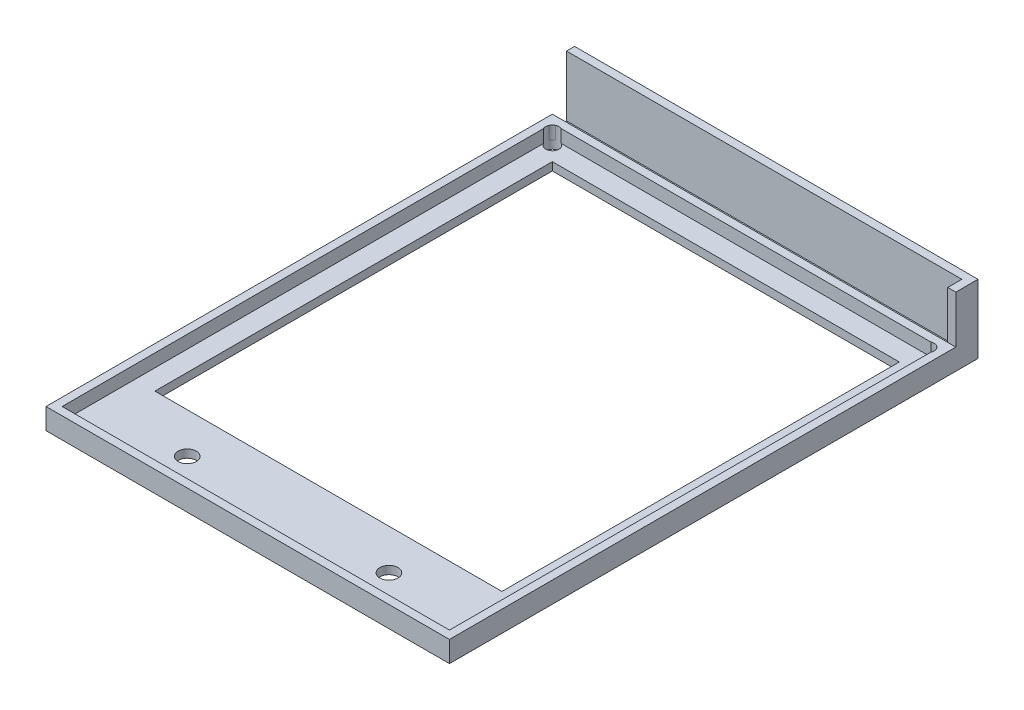
ISO-10303-21;
HEADER;
FILE_DESCRIPTION(('STEP AP214'),'2;1');
FILE_NAME('part.step','',(''),(''),'','','');
FILE_SCHEMA(('AUTOMOTIVE_DESIGN { 1 0 10303 214 1 1 1 1 }'));
ENDSEC;
DATA;
#1=APPLICATION_CONTEXT('core data for automotive mechanical design processes');
#2=APPLICATION_PROTOCOL_DEFINITION('international standard','automotive_design',2000,#1);
#3=PRODUCT_CONTEXT('',#1,'mechanical');
#4=PRODUCT('Part','Part','',(#3));
#5=PRODUCT_RELATED_PRODUCT_CATEGORY('part','',(#4));
#6=PRODUCT_DEFINITION_FORMATION('','',#4);
#7=PRODUCT_DEFINITION_CONTEXT('part definition',#1,'design');
#8=PRODUCT_DEFINITION('design','',#6,#7);
#9=PRODUCT_DEFINITION_SHAPE('','',#8);
#10=(LENGTH_UNIT() NAMED_UNIT(*) SI_UNIT(.MILLI.,.METRE.));
#11=(NAMED_UNIT(*) PLANE_ANGLE_UNIT() SI_UNIT($,.RADIAN.));
#12=(NAMED_UNIT(*) SI_UNIT($,.STERADIAN.) SOLID_ANGLE_UNIT());
#13=UNCERTAINTY_MEASURE_WITH_UNIT(LENGTH_MEASURE(1.E-05),#10,'distance_accuracy_value','');
#14=(GEOMETRIC_REPRESENTATION_CONTEXT(3) GLOBAL_UNCERTAINTY_ASSIGNED_CONTEXT((#13)) GLOBAL_UNIT_ASSIGNED_CONTEXT((#10,
#11,#12)) REPRESENTATION_CONTEXT('',''));
#15=CARTESIAN_POINT('',(0.,0.,0.));
#16=DIRECTION('',(0.,0.,1.));
#17=DIRECTION('',(1.,0.,0.));
#18=AXIS2_PLACEMENT_3D('',#15,#16,#17);
#19=CARTESIAN_POINT('',(-50.,5.2,-62.75));
#20=DIRECTION('',(0.,0.,1.));
#21=DIRECTION('',(1.,0.,0.));
#22=AXIS2_PLACEMENT_3D('',#19,#20,#21);
#23=PLANE('',#22);
#24=DIRECTION('',(0.,-1.,0.));
#25=VECTOR('',#24,1.);
#26=CARTESIAN_POINT('',(48.,17.,-62.75));
#27=LINE('',#26,#25);
#28=CARTESIAN_POINT('',(48.,5.2,-62.75));
#29=VERTEX_POINT('',#28);
#30=CARTESIAN_POINT('',(48.,2.,-62.75));
#31=VERTEX_POINT('',#30);
#32=EDGE_CURVE('E617',#29,#31,#27,.T.);
#33=ORIENTED_EDGE('',*,*,#32,.T.);
#34=DIRECTION('',(1.,0.,0.));
#35=VECTOR('',#34,1.);
#36=CARTESIAN_POINT('',(-50.,2.,-62.75));
#37=LINE('',#36,#35);
#38=CARTESIAN_POINT('',(-50.,2.,-62.75));
#39=VERTEX_POINT('',#38);
#40=EDGE_CURVE('E227',#39,#31,#37,.T.);
#41=ORIENTED_EDGE('',*,*,#40,.F.);
#42=DIRECTION('',(0.,-1.,0.));
#43=VECTOR('',#42,1.);
#44=CARTESIAN_POINT('',(-50.,5.2,-62.75));
#45=LINE('',#44,#43);
#46=CARTESIAN_POINT('',(-50.,5.2,-62.75));
#47=VERTEX_POINT('',#46);
#48=EDGE_CURVE('E321',#47,#39,#45,.T.);
#49=ORIENTED_EDGE('',*,*,#48,.F.);
#50=DIRECTION('',(-1.,0.,0.));
#51=VECTOR('',#50,1.);
#52=CARTESIAN_POINT('',(-50.,5.2,-62.75));
#53=LINE('',#52,#51);
#54=EDGE_CURVE('E50',#29,#47,#53,.T.);
#55=ORIENTED_EDGE('',*,*,#54,.F.);
#56=EDGE_LOOP('',(#33,#41,#49,#55));
#57=FACE_BOUND('',#56,.T.);
#58=ADVANCED_FACE('F35',(#57),#23,.F.);
#59=CARTESIAN_POINT('',(0.,2.,0.));
#60=DIRECTION('',(0.,-1.,0.));
#61=DIRECTION('',(0.,0.,-1.));
#62=AXIS2_PLACEMENT_3D('',#59,#60,#61);
#63=PLANE('',#62);
#64=DIRECTION('',(1.,0.,0.));
#65=VECTOR('',#64,1.);
#66=CARTESIAN_POINT('',(-50.,2.,-66.25));
#67=LINE('',#66,#65);
#68=CARTESIAN_POINT('',(-50.,2.,-66.25));
#69=VERTEX_POINT('',#68);
#70=CARTESIAN_POINT('',(48.,2.,-66.25));
#71=VERTEX_POINT('',#70);
#72=EDGE_CURVE('E619',#69,#71,#67,.T.);
#73=ORIENTED_EDGE('',*,*,#72,.F.);
#74=DIRECTION('',(0.,0.,1.));
#75=VECTOR('',#74,1.);
#76=CARTESIAN_POINT('',(-50.,2.,-62.75));
#77=LINE('',#76,#75);
#78=EDGE_CURVE('E217',#69,#39,#77,.T.);
#79=ORIENTED_EDGE('',*,*,#78,.T.);
#80=ORIENTED_EDGE('',*,*,#40,.T.);
#81=DIRECTION('',(0.,0.,1.));
#82=VECTOR('',#81,1.);
#83=CARTESIAN_POINT('',(48.,2.,-62.75));
#84=LINE('',#83,#82);
#85=EDGE_CURVE('E58',#71,#31,#84,.T.);
#86=ORIENTED_EDGE('',*,*,#85,.F.);
#87=EDGE_LOOP('',(#73,#79,#80,#86));
#88=FACE_BOUND('',#87,.T.);
#89=ADVANCED_FACE('F421',(#88),#63,.F.);
#90=CARTESIAN_POINT('',(0.,2.,0.));
#91=DIRECTION('',(0.,-1.,0.));
#92=DIRECTION('',(0.,0.,-1.));
#93=AXIS2_PLACEMENT_3D('',#90,#91,#92);
#94=PLANE('',#93);
#95=CARTESIAN_POINT('',(-46.5,2.,-59.25));
#96=DIRECTION('',(0.,-1.,0.));
#97=DIRECTION('',(0.,0.,-1.));
#98=AXIS2_PLACEMENT_3D('',#95,#96,#97);
#99=CIRCLE('',#98,1.65);
#100=CARTESIAN_POINT('',(-48.,2.,-58.5626136457566));
#101=VERTEX_POINT('',#100);
#102=CARTESIAN_POINT('',(-45.8126136457567,2.,-60.75));
#103=VERTEX_POINT('',#102);
#104=EDGE_CURVE('E266',#101,#103,#99,.F.);
#105=ORIENTED_EDGE('',*,*,#104,.F.);
#106=DIRECTION('',(0.,0.,1.));
#107=VECTOR('',#106,1.);
#108=CARTESIAN_POINT('',(-48.,2.,60.75));
#109=LINE('',#108,#107);
#110=CARTESIAN_POINT('',(-48.,2.,60.75));
#111=VERTEX_POINT('',#110);
#112=EDGE_CURVE('E360',#101,#111,#109,.T.);
#113=ORIENTED_EDGE('',*,*,#112,.T.);
#114=DIRECTION('',(1.,0.,0.));
#115=VECTOR('',#114,1.);
#116=CARTESIAN_POINT('',(-48.,2.,60.75));
#117=LINE('',#116,#115);
#118=CARTESIAN_POINT('',(48.,2.,60.75));
#119=VERTEX_POINT('',#118);
#120=EDGE_CURVE('E362',#111,#119,#117,.T.);
#121=ORIENTED_EDGE('',*,*,#120,.T.);
#122=DIRECTION('',(0.,0.,-1.));
#123=VECTOR('',#122,1.);
#124=CARTESIAN_POINT('',(48.,2.,60.75));
#125=LINE('',#124,#123);
#126=CARTESIAN_POINT('',(48.,2.,-58.5626136457567));
#127=VERTEX_POINT('',#126);
#128=EDGE_CURVE('E354',#119,#127,#125,.T.);
#129=ORIENTED_EDGE('',*,*,#128,.T.);
#130=CARTESIAN_POINT('',(46.5,2.,-59.25));
#131=DIRECTION('',(0.,-1.,0.));
#132=DIRECTION('',(0.,0.,-1.));
#133=AXIS2_PLACEMENT_3D('',#130,#131,#132);
#134=CIRCLE('',#133,1.65);
#135=CARTESIAN_POINT('',(45.8126136457567,2.,-60.75));
#136=VERTEX_POINT('',#135);
#137=EDGE_CURVE('E251',#136,#127,#134,.F.);
#138=ORIENTED_EDGE('',*,*,#137,.F.);
#139=DIRECTION('',(-1.,0.,0.));
#140=VECTOR('',#139,1.);
#141=CARTESIAN_POINT('',(-48.,2.,-60.75));
#142=LINE('',#141,#140);
#143=EDGE_CURVE('E357',#136,#103,#142,.T.);
#144=ORIENTED_EDGE('',*,*,#143,.T.);
#145=EDGE_LOOP('',(#105,#113,#121,#129,#138,#144));
#146=FACE_BOUND('',#145,.T.);
#147=CARTESIAN_POINT('',(-25.,2.,52.75));
#148=DIRECTION('',(0.,-1.,0.));
#149=DIRECTION('',(0.,0.,-1.));
#150=AXIS2_PLACEMENT_3D('',#147,#148,#149);
#151=CIRCLE('',#150,2.25);
#152=CARTESIAN_POINT('',(-25.,2.,55.));
#153=VERTEX_POINT('',#152);
#154=EDGE_CURVE('E235',#153,#153,#151,.F.);
#155=ORIENTED_EDGE('',*,*,#154,.F.);
#156=EDGE_LOOP('',(#155));
#157=FACE_BOUND('',#156,.T.);
#158=CARTESIAN_POINT('',(25.,2.,52.75));
#159=DIRECTION('',(0.,-1.,0.));
#160=DIRECTION('',(0.,0.,-1.));
#161=AXIS2_PLACEMENT_3D('',#158,#159,#160);
#162=CIRCLE('',#161,2.25);
#163=CARTESIAN_POINT('',(25.,2.,55.));
#164=VERTEX_POINT('',#163);
#165=EDGE_CURVE('E238',#164,#164,#162,.F.);
#166=ORIENTED_EDGE('',*,*,#165,.F.);
#167=EDGE_LOOP('',(#166));
#168=FACE_BOUND('',#167,.T.);
#169=DIRECTION('',(0.,0.,1.));
#170=VECTOR('',#169,1.);
#171=CARTESIAN_POINT('',(-43.,2.,-55.75));
#172=LINE('',#171,#170);
#173=CARTESIAN_POINT('',(-43.,2.,-55.75));
#174=VERTEX_POINT('',#173);
#175=CARTESIAN_POINT('',(-43.,2.,42.75));
#176=VERTEX_POINT('',#175);
#177=EDGE_CURVE('E324',#174,#176,#172,.T.);
#178=ORIENTED_EDGE('',*,*,#177,.F.);
#179=DIRECTION('',(-1.,0.,0.));
#180=VECTOR('',#179,1.);
#181=CARTESIAN_POINT('',(-43.,2.,-55.75));
#182=LINE('',#181,#180);
#183=CARTESIAN_POINT('',(43.,2.,-55.75));
#184=VERTEX_POINT('',#183);
#185=EDGE_CURVE('E332',#184,#174,#182,.T.);
#186=ORIENTED_EDGE('',*,*,#185,.F.);
#187=DIRECTION('',(0.,0.,-1.));
#188=VECTOR('',#187,1.);
#189=CARTESIAN_POINT('',(43.,2.,-55.75));
#190=LINE('',#189,#188);
#191=CARTESIAN_POINT('',(43.,2.,42.75));
#192=VERTEX_POINT('',#191);
#193=EDGE_CURVE('E329',#192,#184,#190,.T.);
#194=ORIENTED_EDGE('',*,*,#193,.F.);
#195=DIRECTION('',(1.,0.,0.));
#196=VECTOR('',#195,1.);
#197=CARTESIAN_POINT('',(-43.,2.,42.75));
#198=LINE('',#197,#196);
#199=EDGE_CURVE('E326',#176,#192,#198,.T.);
#200=ORIENTED_EDGE('',*,*,#199,.F.);
#201=EDGE_LOOP('',(#178,#186,#194,#200));
#202=FACE_BOUND('',#201,.T.);
#203=ADVANCED_FACE('F404',(#146,#157,#168,#202),#94,.F.);
#204=CARTESIAN_POINT('',(-48.,5.2,-60.75));
#205=DIRECTION('',(0.,0.,1.));
#206=DIRECTION('',(1.,0.,0.));
#207=AXIS2_PLACEMENT_3D('',#204,#205,#206);
#208=PLANE('',#207);
#209=DIRECTION('',(-1.,0.,0.));
#210=VECTOR('',#209,1.);
#211=CARTESIAN_POINT('',(-48.,5.2,-60.75));
#212=LINE('',#211,#210);
#213=CARTESIAN_POINT('',(45.8126136457567,5.2,-60.75));
#214=VERTEX_POINT('',#213);
#215=CARTESIAN_POINT('',(-45.8126136457567,5.2,-60.75));
#216=VERTEX_POINT('',#215);
#217=EDGE_CURVE('E292',#214,#216,#212,.T.);
#218=ORIENTED_EDGE('',*,*,#217,.T.);
#219=DIRECTION('',(0.,-1.,0.));
#220=VECTOR('',#219,1.);
#221=CARTESIAN_POINT('',(-45.8126136457567,5.201,-60.75));
#222=LINE('',#221,#220);
#223=EDGE_CURVE('E260',#216,#103,#222,.T.);
#224=ORIENTED_EDGE('',*,*,#223,.T.);
#225=ORIENTED_EDGE('',*,*,#143,.F.);
#226=DIRECTION('',(0.,-1.,0.));
#227=VECTOR('',#226,1.);
#228=CARTESIAN_POINT('',(45.8126136457567,5.201,-60.75));
#229=LINE('',#228,#227);
#230=EDGE_CURVE('E246',#136,#214,#229,.F.);
#231=ORIENTED_EDGE('',*,*,#230,.T.);
#232=EDGE_LOOP('',(#218,#224,#225,#231));
#233=FACE_BOUND('',#232,.T.);
#234=ADVANCED_FACE('F385',(#233),#208,.T.);
#235=CARTESIAN_POINT('',(-48.,5.2,-60.75));
#236=DIRECTION('',(1.,0.,0.));
#237=DIRECTION('',(0.,0.,-1.));
#238=AXIS2_PLACEMENT_3D('',#235,#236,#237);
#239=PLANE('',#238);
#240=ORIENTED_EDGE('',*,*,#112,.F.);
#241=DIRECTION('',(0.,-1.,0.));
#242=VECTOR('',#241,1.);
#243=CARTESIAN_POINT('',(-48.,5.201,-58.5626136457566));
#244=LINE('',#243,#242);
#245=CARTESIAN_POINT('',(-48.,5.2,-58.5626136457566));
#246=VERTEX_POINT('',#245);
#247=EDGE_CURVE('E272',#101,#246,#244,.F.);
#248=ORIENTED_EDGE('',*,*,#247,.T.);
#249=DIRECTION('',(0.,0.,1.));
#250=VECTOR('',#249,1.);
#251=CARTESIAN_POINT('',(-48.,5.2,-60.75));
#252=LINE('',#251,#250);
#253=CARTESIAN_POINT('',(-48.,5.2,60.75));
#254=VERTEX_POINT('',#253);
#255=EDGE_CURVE('E284',#246,#254,#252,.T.);
#256=ORIENTED_EDGE('',*,*,#255,.T.);
#257=DIRECTION('',(0.,-1.,0.));
#258=VECTOR('',#257,1.);
#259=CARTESIAN_POINT('',(-48.,5.2,60.75));
#260=LINE('',#259,#258);
#261=EDGE_CURVE('E298',#254,#111,#260,.T.);
#262=ORIENTED_EDGE('',*,*,#261,.T.);
#263=EDGE_LOOP('',(#240,#248,#256,#262));
#264=FACE_BOUND('',#263,.T.);
#265=ADVANCED_FACE('F397',(#264),#239,.T.);
#266=CARTESIAN_POINT('',(48.,5.2,-60.75));
#267=DIRECTION('',(-1.,0.,0.));
#268=DIRECTION('',(0.,0.,1.));
#269=AXIS2_PLACEMENT_3D('',#266,#267,#268);
#270=PLANE('',#269);
#271=DIRECTION('',(0.,0.,-1.));
#272=VECTOR('',#271,1.);
#273=CARTESIAN_POINT('',(48.,5.2,-60.75));
#274=LINE('',#273,#272);
#275=CARTESIAN_POINT('',(48.,5.2,60.75));
#276=VERTEX_POINT('',#275);
#277=CARTESIAN_POINT('',(48.,5.2,-58.5626136457566));
#278=VERTEX_POINT('',#277);
#279=EDGE_CURVE('E289',#276,#278,#274,.T.);
#280=ORIENTED_EDGE('',*,*,#279,.T.);
#281=DIRECTION('',(0.,-1.,0.));
#282=VECTOR('',#281,1.);
#283=CARTESIAN_POINT('',(48.,5.201,-58.5626136457566));
#284=LINE('',#283,#282);
#285=EDGE_CURVE('E252',#278,#127,#284,.T.);
#286=ORIENTED_EDGE('',*,*,#285,.T.);
#287=ORIENTED_EDGE('',*,*,#128,.F.);
#288=DIRECTION('',(0.,-1.,0.));
#289=VECTOR('',#288,1.);
#290=CARTESIAN_POINT('',(48.,5.2,60.75));
#291=LINE('',#290,#289);
#292=EDGE_CURVE('E295',#276,#119,#291,.T.);
#293=ORIENTED_EDGE('',*,*,#292,.F.);
#294=EDGE_LOOP('',(#280,#286,#287,#293));
#295=FACE_BOUND('',#294,.T.);
#296=ADVANCED_FACE('F407',(#295),#270,.T.);
#297=CARTESIAN_POINT('',(0.,5.2,0.));
#298=DIRECTION('',(0.,-1.,0.));
#299=DIRECTION('',(0.,0.,-1.));
#300=AXIS2_PLACEMENT_3D('',#297,#298,#299);
#301=PLANE('',#300);
#302=DIRECTION('',(0.,0.,-1.));
#303=VECTOR('',#302,1.);
#304=CARTESIAN_POINT('',(50.,5.2,62.75));
#305=LINE('',#304,#303);
#306=CARTESIAN_POINT('',(50.,5.2,62.75));
#307=VERTEX_POINT('',#306);
#308=CARTESIAN_POINT('',(50.,5.2,-62.75));
#309=VERTEX_POINT('',#308);
#310=EDGE_CURVE('E302',#307,#309,#305,.T.);
#311=ORIENTED_EDGE('',*,*,#310,.T.);
#312=EDGE_CURVE('E305',#309,#29,#53,.T.);
#313=ORIENTED_EDGE('',*,*,#312,.T.);
#314=ORIENTED_EDGE('',*,*,#54,.T.);
#315=DIRECTION('',(0.,0.,1.));
#316=VECTOR('',#315,1.);
#317=CARTESIAN_POINT('',(-50.,5.2,62.75));
#318=LINE('',#317,#316);
#319=CARTESIAN_POINT('',(-50.,5.2,62.75));
#320=VERTEX_POINT('',#319);
#321=EDGE_CURVE('E307',#47,#320,#318,.T.);
#322=ORIENTED_EDGE('',*,*,#321,.T.);
#323=DIRECTION('',(1.,0.,0.));
#324=VECTOR('',#323,1.);
#325=CARTESIAN_POINT('',(-50.,5.2,62.75));
#326=LINE('',#325,#324);
#327=EDGE_CURVE('E309',#320,#307,#326,.T.);
#328=ORIENTED_EDGE('',*,*,#327,.T.);
#329=EDGE_LOOP('',(#311,#313,#314,#322,#328));
#330=FACE_BOUND('',#329,.T.);
#331=CARTESIAN_POINT('',(-46.5,5.2,-59.25));
#332=DIRECTION('',(0.,-1.,0.));
#333=DIRECTION('',(0.,0.,-1.));
#334=AXIS2_PLACEMENT_3D('',#331,#332,#333);
#335=CIRCLE('',#334,1.65);
#336=CARTESIAN_POINT('',(-48.,5.2,-59.9373863542434));
#337=VERTEX_POINT('',#336);
#338=EDGE_CURVE('E243',#337,#246,#335,.F.);
#339=ORIENTED_EDGE('',*,*,#338,.F.);
#340=CARTESIAN_POINT('',(-46.5,5.2,-59.25));
#341=DIRECTION('',(0.,-1.,0.));
#342=DIRECTION('',(0.,0.,-1.));
#343=AXIS2_PLACEMENT_3D('',#340,#341,#342);
#344=CIRCLE('',#343,1.65);
#345=CARTESIAN_POINT('',(-47.1873863542434,5.2,-60.75));
#346=VERTEX_POINT('',#345);
#347=EDGE_CURVE('E11',#337,#346,#344,.T.);
#348=ORIENTED_EDGE('',*,*,#347,.T.);
#349=EDGE_CURVE('E234',#216,#346,#335,.F.);
#350=ORIENTED_EDGE('',*,*,#349,.F.);
#351=ORIENTED_EDGE('',*,*,#217,.F.);
#352=CARTESIAN_POINT('',(46.5,5.2,-59.25));
#353=DIRECTION('',(0.,-1.,0.));
#354=DIRECTION('',(0.,0.,-1.));
#355=AXIS2_PLACEMENT_3D('',#352,#353,#354);
#356=CIRCLE('',#355,1.65);
#357=CARTESIAN_POINT('',(47.1873863542434,5.2,-60.75));
#358=VERTEX_POINT('',#357);
#359=EDGE_CURVE('E240',#358,#214,#356,.F.);
#360=ORIENTED_EDGE('',*,*,#359,.F.);
#361=CARTESIAN_POINT('',(46.5,5.2,-59.25));
#362=DIRECTION('',(0.,-1.,0.));
#363=DIRECTION('',(0.,0.,-1.));
#364=AXIS2_PLACEMENT_3D('',#361,#362,#363);
#365=CIRCLE('',#364,1.65);
#366=CARTESIAN_POINT('',(48.,5.2,-59.9373863542434));
#367=VERTEX_POINT('',#366);
#368=EDGE_CURVE('E43',#358,#367,#365,.T.);
#369=ORIENTED_EDGE('',*,*,#368,.T.);
#370=EDGE_CURVE('E239',#278,#367,#356,.F.);
#371=ORIENTED_EDGE('',*,*,#370,.F.);
#372=ORIENTED_EDGE('',*,*,#279,.F.);
#373=DIRECTION('',(1.,0.,0.));
#374=VECTOR('',#373,1.);
#375=CARTESIAN_POINT('',(-48.,5.2,60.75));
#376=LINE('',#375,#374);
#377=EDGE_CURVE('E286',#254,#276,#376,.T.);
#378=ORIENTED_EDGE('',*,*,#377,.F.);
#379=ORIENTED_EDGE('',*,*,#255,.F.);
#380=EDGE_LOOP('',(#339,#348,#350,#351,#360,#369,#371,#372,#378,#379));
#381=FACE_BOUND('',#380,.T.);
#382=ADVANCED_FACE('F374',(#330,#381),#301,.F.);
#383=CARTESIAN_POINT('',(0.,0.,0.));
#384=DIRECTION('',(0.,-1.,0.));
#385=DIRECTION('',(0.,0.,-1.));
#386=AXIS2_PLACEMENT_3D('',#383,#384,#385);
#387=PLANE('',#386);
#388=CARTESIAN_POINT('',(-46.5,0.,-59.25));
#389=DIRECTION('',(0.,-1.,0.));
#390=DIRECTION('',(0.,0.,-1.));
#391=AXIS2_PLACEMENT_3D('',#388,#389,#390);
#392=CIRCLE('',#391,1.65);
#393=CARTESIAN_POINT('',(-46.5,0.,-60.9));
#394=VERTEX_POINT('',#393);
#395=EDGE_CURVE('E280',#394,#394,#392,.F.);
#396=ORIENTED_EDGE('',*,*,#395,.T.);
#397=EDGE_LOOP('',(#396));
#398=FACE_BOUND('',#397,.T.);
#399=CARTESIAN_POINT('',(46.5,0.,-59.25));
#400=DIRECTION('',(0.,-1.,0.));
#401=DIRECTION('',(0.,0.,-1.));
#402=AXIS2_PLACEMENT_3D('',#399,#400,#401);
#403=CIRCLE('',#402,1.65);
#404=CARTESIAN_POINT('',(46.5,0.,-60.9));
#405=VERTEX_POINT('',#404);
#406=EDGE_CURVE('E277',#405,#405,#403,.F.);
#407=ORIENTED_EDGE('',*,*,#406,.T.);
#408=EDGE_LOOP('',(#407));
#409=FACE_BOUND('',#408,.T.);
#410=CARTESIAN_POINT('',(-25.,0.,52.75));
#411=DIRECTION('',(0.,-1.,0.));
#412=DIRECTION('',(0.,0.,-1.));
#413=AXIS2_PLACEMENT_3D('',#410,#411,#412);
#414=CIRCLE('',#413,2.25);
#415=CARTESIAN_POINT('',(-25.,0.,55.));
#416=VERTEX_POINT('',#415);
#417=EDGE_CURVE('E287',#416,#416,#414,.F.);
#418=ORIENTED_EDGE('',*,*,#417,.T.);
#419=EDGE_LOOP('',(#418));
#420=FACE_BOUND('',#419,.T.);
#421=CARTESIAN_POINT('',(25.,0.,52.75));
#422=DIRECTION('',(0.,-1.,0.));
#423=DIRECTION('',(0.,0.,-1.));
#424=AXIS2_PLACEMENT_3D('',#421,#422,#423);
#425=CIRCLE('',#424,2.25);
#426=CARTESIAN_POINT('',(25.,0.,55.));
#427=VERTEX_POINT('',#426);
#428=EDGE_CURVE('E283',#427,#427,#425,.F.);
#429=ORIENTED_EDGE('',*,*,#428,.T.);
#430=EDGE_LOOP('',(#429));
#431=FACE_BOUND('',#430,.T.);
#432=DIRECTION('',(-1.,0.,0.));
#433=VECTOR('',#432,1.);
#434=CARTESIAN_POINT('',(-43.,0.,-55.75));
#435=LINE('',#434,#433);
#436=CARTESIAN_POINT('',(43.,0.,-55.75));
#437=VERTEX_POINT('',#436);
#438=CARTESIAN_POINT('',(-43.,0.,-55.75));
#439=VERTEX_POINT('',#438);
#440=EDGE_CURVE('E327',#437,#439,#435,.T.);
#441=ORIENTED_EDGE('',*,*,#440,.T.);
#442=DIRECTION('',(0.,0.,1.));
#443=VECTOR('',#442,1.);
#444=CARTESIAN_POINT('',(-43.,0.,-55.75));
#445=LINE('',#444,#443);
#446=CARTESIAN_POINT('',(-43.,0.,42.75));
#447=VERTEX_POINT('',#446);
#448=EDGE_CURVE('E323',#439,#447,#445,.T.);
#449=ORIENTED_EDGE('',*,*,#448,.T.);
#450=DIRECTION('',(1.,0.,0.));
#451=VECTOR('',#450,1.);
#452=CARTESIAN_POINT('',(-43.,0.,42.75));
#453=LINE('',#452,#451);
#454=CARTESIAN_POINT('',(43.,0.,42.75));
#455=VERTEX_POINT('',#454);
#456=EDGE_CURVE('E337',#447,#455,#453,.T.);
#457=ORIENTED_EDGE('',*,*,#456,.T.);
#458=DIRECTION('',(0.,0.,-1.));
#459=VECTOR('',#458,1.);
#460=CARTESIAN_POINT('',(43.,0.,-55.75));
#461=LINE('',#460,#459);
#462=EDGE_CURVE('E340',#455,#437,#461,.T.);
#463=ORIENTED_EDGE('',*,*,#462,.T.);
#464=EDGE_LOOP('',(#441,#449,#457,#463));
#465=FACE_BOUND('',#464,.T.);
#466=DIRECTION('',(0.,0.,-1.));
#467=VECTOR('',#466,1.);
#468=CARTESIAN_POINT('',(50.,0.,62.75));
#469=LINE('',#468,#467);
#470=CARTESIAN_POINT('',(50.,0.,62.75));
#471=VERTEX_POINT('',#470);
#472=CARTESIAN_POINT('',(50.,0.,-68.25));
#473=VERTEX_POINT('',#472);
#474=EDGE_CURVE('E301',#471,#473,#469,.T.);
#475=ORIENTED_EDGE('',*,*,#474,.F.);
#476=DIRECTION('',(1.,0.,0.));
#477=VECTOR('',#476,1.);
#478=CARTESIAN_POINT('',(-50.,0.,62.75));
#479=LINE('',#478,#477);
#480=CARTESIAN_POINT('',(-50.,0.,62.75));
#481=VERTEX_POINT('',#480);
#482=EDGE_CURVE('E304',#481,#471,#479,.T.);
#483=ORIENTED_EDGE('',*,*,#482,.F.);
#484=DIRECTION('',(0.,0.,1.));
#485=VECTOR('',#484,1.);
#486=CARTESIAN_POINT('',(-50.,0.,62.75));
#487=LINE('',#486,#485);
#488=CARTESIAN_POINT('',(-50.,0.,-68.25));
#489=VERTEX_POINT('',#488);
#490=EDGE_CURVE('E313',#489,#481,#487,.T.);
#491=ORIENTED_EDGE('',*,*,#490,.F.);
#492=DIRECTION('',(-1.,0.,0.));
#493=VECTOR('',#492,1.);
#494=CARTESIAN_POINT('',(-50.,0.,-68.25));
#495=LINE('',#494,#493);
#496=EDGE_CURVE('E218',#473,#489,#495,.T.);
#497=ORIENTED_EDGE('',*,*,#496,.F.);
#498=EDGE_LOOP('',(#475,#483,#491,#497));
#499=FACE_BOUND('',#498,.T.);
#500=ADVANCED_FACE('F414',(#398,#409,#420,#431,#465,#499),#387,.T.);
#501=CARTESIAN_POINT('',(-43.,2.,-55.75));
#502=DIRECTION('',(1.,0.,0.));
#503=DIRECTION('',(0.,0.,-1.));
#504=AXIS2_PLACEMENT_3D('',#501,#502,#503);
#505=PLANE('',#504);
#506=ORIENTED_EDGE('',*,*,#448,.F.);
#507=DIRECTION('',(0.,-1.,0.));
#508=VECTOR('',#507,1.);
#509=CARTESIAN_POINT('',(-43.,2.,-55.75));
#510=LINE('',#509,#508);
#511=EDGE_CURVE('E334',#174,#439,#510,.T.);
#512=ORIENTED_EDGE('',*,*,#511,.F.);
#513=ORIENTED_EDGE('',*,*,#177,.T.);
#514=DIRECTION('',(0.,-1.,0.));
#515=VECTOR('',#514,1.);
#516=CARTESIAN_POINT('',(-43.,2.,42.75));
#517=LINE('',#516,#515);
#518=EDGE_CURVE('E351',#176,#447,#517,.T.);
#519=ORIENTED_EDGE('',*,*,#518,.T.);
#520=EDGE_LOOP('',(#506,#512,#513,#519));
#521=FACE_BOUND('',#520,.T.);
#522=ADVANCED_FACE('F445',(#521),#505,.T.);
#523=CARTESIAN_POINT('',(-43.,2.,42.75));
#524=DIRECTION('',(0.,0.,-1.));
#525=DIRECTION('',(-1.,0.,0.));
#526=AXIS2_PLACEMENT_3D('',#523,#524,#525);
#527=PLANE('',#526);
#528=ORIENTED_EDGE('',*,*,#456,.F.);
#529=ORIENTED_EDGE('',*,*,#518,.F.);
#530=ORIENTED_EDGE('',*,*,#199,.T.);
#531=DIRECTION('',(0.,-1.,0.));
#532=VECTOR('',#531,1.);
#533=CARTESIAN_POINT('',(43.,2.,42.75));
#534=LINE('',#533,#532);
#535=EDGE_CURVE('E349',#192,#455,#534,.T.);
#536=ORIENTED_EDGE('',*,*,#535,.T.);
#537=EDGE_LOOP('',(#528,#529,#530,#536));
#538=FACE_BOUND('',#537,.T.);
#539=ADVANCED_FACE('F441',(#538),#527,.T.);
#540=CARTESIAN_POINT('',(43.,2.,-55.75));
#541=DIRECTION('',(-1.,0.,0.));
#542=DIRECTION('',(0.,0.,1.));
#543=AXIS2_PLACEMENT_3D('',#540,#541,#542);
#544=PLANE('',#543);
#545=ORIENTED_EDGE('',*,*,#462,.F.);
#546=ORIENTED_EDGE('',*,*,#535,.F.);
#547=ORIENTED_EDGE('',*,*,#193,.T.);
#548=DIRECTION('',(0.,-1.,0.));
#549=VECTOR('',#548,1.);
#550=CARTESIAN_POINT('',(43.,2.,-55.75));
#551=LINE('',#550,#549);
#552=EDGE_CURVE('E347',#184,#437,#551,.T.);
#553=ORIENTED_EDGE('',*,*,#552,.T.);
#554=EDGE_LOOP('',(#545,#546,#547,#553));
#555=FACE_BOUND('',#554,.T.);
#556=ADVANCED_FACE('F437',(#555),#544,.T.);
#557=CARTESIAN_POINT('',(-43.,2.,-55.75));
#558=DIRECTION('',(0.,0.,1.));
#559=DIRECTION('',(1.,0.,0.));
#560=AXIS2_PLACEMENT_3D('',#557,#558,#559);
#561=PLANE('',#560);
#562=ORIENTED_EDGE('',*,*,#440,.F.);
#563=ORIENTED_EDGE('',*,*,#552,.F.);
#564=ORIENTED_EDGE('',*,*,#185,.T.);
#565=ORIENTED_EDGE('',*,*,#511,.T.);
#566=EDGE_LOOP('',(#562,#563,#564,#565));
#567=FACE_BOUND('',#566,.T.);
#568=ADVANCED_FACE('F434',(#567),#561,.T.);
#569=CARTESIAN_POINT('',(-48.,5.2,60.75));
#570=DIRECTION('',(0.,0.,-1.));
#571=DIRECTION('',(-1.,0.,0.));
#572=AXIS2_PLACEMENT_3D('',#569,#570,#571);
#573=PLANE('',#572);
#574=ORIENTED_EDGE('',*,*,#120,.F.);
#575=ORIENTED_EDGE('',*,*,#261,.F.);
#576=ORIENTED_EDGE('',*,*,#377,.T.);
#577=ORIENTED_EDGE('',*,*,#292,.T.);
#578=EDGE_LOOP('',(#574,#575,#576,#577));
#579=FACE_BOUND('',#578,.T.);
#580=ADVANCED_FACE('F400',(#579),#573,.T.);
#581=CARTESIAN_POINT('',(50.,5.2,62.75));
#582=DIRECTION('',(-1.,0.,0.));
#583=DIRECTION('',(0.,0.,1.));
#584=AXIS2_PLACEMENT_3D('',#581,#582,#583);
#585=PLANE('',#584);
#586=ORIENTED_EDGE('',*,*,#474,.T.);
#587=DIRECTION('',(0.,-1.,0.));
#588=VECTOR('',#587,1.);
#589=CARTESIAN_POINT('',(50.,2.,-68.25));
#590=LINE('',#589,#588);
#591=CARTESIAN_POINT('',(50.,17.,-68.25));
#592=VERTEX_POINT('',#591);
#593=EDGE_CURVE('E231',#592,#473,#590,.T.);
#594=ORIENTED_EDGE('',*,*,#593,.F.);
#595=DIRECTION('',(0.,0.,-1.));
#596=VECTOR('',#595,1.);
#597=CARTESIAN_POINT('',(50.,17.,-68.25));
#598=LINE('',#597,#596);
#599=CARTESIAN_POINT('',(50.,17.,-62.75));
#600=VERTEX_POINT('',#599);
#601=EDGE_CURVE('E636',#600,#592,#598,.T.);
#602=ORIENTED_EDGE('',*,*,#601,.F.);
#603=DIRECTION('',(0.,-1.,0.));
#604=VECTOR('',#603,1.);
#605=CARTESIAN_POINT('',(50.,17.,-62.75));
#606=LINE('',#605,#604);
#607=EDGE_CURVE('E624',#600,#309,#606,.T.);
#608=ORIENTED_EDGE('',*,*,#607,.T.);
#609=ORIENTED_EDGE('',*,*,#310,.F.);
#610=DIRECTION('',(0.,-1.,0.));
#611=VECTOR('',#610,1.);
#612=CARTESIAN_POINT('',(50.,5.2,62.75));
#613=LINE('',#612,#611);
#614=EDGE_CURVE('E311',#307,#471,#613,.T.);
#615=ORIENTED_EDGE('',*,*,#614,.T.);
#616=EDGE_LOOP('',(#586,#594,#602,#608,#609,#615));
#617=FACE_BOUND('',#616,.T.);
#618=ADVANCED_FACE('F430',(#617),#585,.F.);
#619=CARTESIAN_POINT('',(-50.,5.2,62.75));
#620=DIRECTION('',(1.,0.,0.));
#621=DIRECTION('',(0.,0.,-1.));
#622=AXIS2_PLACEMENT_3D('',#619,#620,#621);
#623=PLANE('',#622);
#624=ORIENTED_EDGE('',*,*,#490,.T.);
#625=DIRECTION('',(0.,-1.,0.));
#626=VECTOR('',#625,1.);
#627=CARTESIAN_POINT('',(-50.,5.2,62.75));
#628=LINE('',#627,#626);
#629=EDGE_CURVE('E318',#320,#481,#628,.T.);
#630=ORIENTED_EDGE('',*,*,#629,.F.);
#631=ORIENTED_EDGE('',*,*,#321,.F.);
#632=ORIENTED_EDGE('',*,*,#48,.T.);
#633=ORIENTED_EDGE('',*,*,#78,.F.);
#634=DIRECTION('',(0.,-1.,0.));
#635=VECTOR('',#634,1.);
#636=CARTESIAN_POINT('',(-50.,17.,-66.25));
#637=LINE('',#636,#635);
#638=CARTESIAN_POINT('',(-50.,17.,-66.25));
#639=VERTEX_POINT('',#638);
#640=EDGE_CURVE('E197',#639,#69,#637,.T.);
#641=ORIENTED_EDGE('',*,*,#640,.F.);
#642=DIRECTION('',(0.,0.,1.));
#643=VECTOR('',#642,1.);
#644=CARTESIAN_POINT('',(-50.,17.,-68.25));
#645=LINE('',#644,#643);
#646=CARTESIAN_POINT('',(-50.,17.,-68.25));
#647=VERTEX_POINT('',#646);
#648=EDGE_CURVE('E203',#647,#639,#645,.T.);
#649=ORIENTED_EDGE('',*,*,#648,.F.);
#650=DIRECTION('',(0.,-1.,0.));
#651=VECTOR('',#650,1.);
#652=CARTESIAN_POINT('',(-50.,2.,-68.25));
#653=LINE('',#652,#651);
#654=EDGE_CURVE('E228',#647,#489,#653,.T.);
#655=ORIENTED_EDGE('',*,*,#654,.T.);
#656=EDGE_LOOP('',(#624,#630,#631,#632,#633,#641,#649,#655));
#657=FACE_BOUND('',#656,.T.);
#658=ADVANCED_FACE('F215',(#657),#623,.F.);
#659=CARTESIAN_POINT('',(-50.,5.2,62.75));
#660=DIRECTION('',(0.,0.,-1.));
#661=DIRECTION('',(-1.,0.,0.));
#662=AXIS2_PLACEMENT_3D('',#659,#660,#661);
#663=PLANE('',#662);
#664=ORIENTED_EDGE('',*,*,#482,.T.);
#665=ORIENTED_EDGE('',*,*,#614,.F.);
#666=ORIENTED_EDGE('',*,*,#327,.F.);
#667=ORIENTED_EDGE('',*,*,#629,.T.);
#668=EDGE_LOOP('',(#664,#665,#666,#667));
#669=FACE_BOUND('',#668,.T.);
#670=ADVANCED_FACE('F475',(#669),#663,.F.);
#671=CARTESIAN_POINT('',(46.5,-1.2E-05,-59.25));
#672=DIRECTION('',(0.,1.,0.));
#673=DIRECTION('',(0.,0.,1.));
#674=AXIS2_PLACEMENT_3D('',#671,#672,#673);
#675=CYLINDRICAL_SURFACE('',#674,1.65);
#676=ORIENTED_EDGE('',*,*,#406,.F.);
#677=EDGE_LOOP('',(#676));
#678=FACE_BOUND('',#677,.T.);
#679=ORIENTED_EDGE('',*,*,#370,.T.);
#680=DIRECTION('',(0.,-1.,0.));
#681=VECTOR('',#680,1.);
#682=CARTESIAN_POINT('',(48.,5.201,-59.9373863542434));
#683=LINE('',#682,#681);
#684=CARTESIAN_POINT('',(48.,2.,-59.9373863542433));
#685=VERTEX_POINT('',#684);
#686=EDGE_CURVE('E255',#685,#367,#683,.F.);
#687=ORIENTED_EDGE('',*,*,#686,.F.);
#688=CARTESIAN_POINT('',(47.1873863542434,2.,-60.75));
#689=VERTEX_POINT('',#688);
#690=EDGE_CURVE('E249',#685,#689,#134,.F.);
#691=ORIENTED_EDGE('',*,*,#690,.T.);
#692=DIRECTION('',(0.,-1.,0.));
#693=VECTOR('',#692,1.);
#694=CARTESIAN_POINT('',(47.1873863542434,5.201,-60.75));
#695=LINE('',#694,#693);
#696=EDGE_CURVE('E242',#358,#689,#695,.T.);
#697=ORIENTED_EDGE('',*,*,#696,.F.);
#698=ORIENTED_EDGE('',*,*,#359,.T.);
#699=ORIENTED_EDGE('',*,*,#230,.F.);
#700=ORIENTED_EDGE('',*,*,#137,.T.);
#701=ORIENTED_EDGE('',*,*,#285,.F.);
#702=EDGE_LOOP('',(#679,#687,#691,#697,#698,#699,#700,#701));
#703=FACE_BOUND('',#702,.T.);
#704=ADVANCED_FACE('F380',(#678,#703),#675,.F.);
#705=CARTESIAN_POINT('',(-46.5,-1.2E-05,-59.25));
#706=DIRECTION('',(0.,1.,0.));
#707=DIRECTION('',(0.,0.,1.));
#708=AXIS2_PLACEMENT_3D('',#705,#706,#707);
#709=CYLINDRICAL_SURFACE('',#708,1.65);
#710=ORIENTED_EDGE('',*,*,#395,.F.);
#711=EDGE_LOOP('',(#710));
#712=FACE_BOUND('',#711,.T.);
#713=ORIENTED_EDGE('',*,*,#338,.T.);
#714=ORIENTED_EDGE('',*,*,#247,.F.);
#715=ORIENTED_EDGE('',*,*,#104,.T.);
#716=ORIENTED_EDGE('',*,*,#223,.F.);
#717=ORIENTED_EDGE('',*,*,#349,.T.);
#718=DIRECTION('',(0.,-1.,0.));
#719=VECTOR('',#718,1.);
#720=CARTESIAN_POINT('',(-47.1873863542434,5.201,-60.75));
#721=LINE('',#720,#719);
#722=CARTESIAN_POINT('',(-47.1873863542434,2.,-60.75));
#723=VERTEX_POINT('',#722);
#724=EDGE_CURVE('E263',#723,#346,#721,.F.);
#725=ORIENTED_EDGE('',*,*,#724,.F.);
#726=CARTESIAN_POINT('',(-48.,2.,-59.9373863542434));
#727=VERTEX_POINT('',#726);
#728=EDGE_CURVE('E268',#723,#727,#99,.F.);
#729=ORIENTED_EDGE('',*,*,#728,.T.);
#730=DIRECTION('',(0.,-1.,0.));
#731=VECTOR('',#730,1.);
#732=CARTESIAN_POINT('',(-48.,5.201,-59.9373863542434));
#733=LINE('',#732,#731);
#734=EDGE_CURVE('E269',#337,#727,#733,.T.);
#735=ORIENTED_EDGE('',*,*,#734,.F.);
#736=EDGE_LOOP('',(#713,#714,#715,#716,#717,#725,#729,#735));
#737=FACE_BOUND('',#736,.T.);
#738=ADVANCED_FACE('F390',(#712,#737),#709,.F.);
#739=CARTESIAN_POINT('',(25.,-1.2E-05,52.75));
#740=DIRECTION('',(0.,1.,0.));
#741=DIRECTION('',(0.,0.,1.));
#742=AXIS2_PLACEMENT_3D('',#739,#740,#741);
#743=CYLINDRICAL_SURFACE('',#742,2.25);
#744=CARTESIAN_POINT('',(25.,0.,55.));
#745=CARTESIAN_POINT('',(25.,0.0208333333333333,55.));
#746=CARTESIAN_POINT('',(25.,0.0416666666666667,55.));
#747=CARTESIAN_POINT('',(25.,0.0833333333333333,55.));
#748=CARTESIAN_POINT('',(25.,0.104166666666667,55.));
#749=CARTESIAN_POINT('',(25.,0.145833333333333,55.));
#750=CARTESIAN_POINT('',(25.,0.166666666666667,55.));
#751=CARTESIAN_POINT('',(25.,0.208333333333333,55.));
#752=CARTESIAN_POINT('',(25.,0.229166666666667,55.));
#753=CARTESIAN_POINT('',(25.,0.270833333333333,55.));
#754=CARTESIAN_POINT('',(25.,0.291666666666667,55.));
#755=CARTESIAN_POINT('',(25.,0.333333333333333,55.));
#756=CARTESIAN_POINT('',(25.,0.354166666666667,55.));
#757=CARTESIAN_POINT('',(25.,0.395833333333333,55.));
#758=CARTESIAN_POINT('',(25.,0.416666666666667,55.));
#759=CARTESIAN_POINT('',(25.,0.458333333333333,55.));
#760=CARTESIAN_POINT('',(25.,0.479166666666667,55.));
#761=CARTESIAN_POINT('',(25.,0.520833333333333,55.));
#762=CARTESIAN_POINT('',(25.,0.541666666666667,55.));
#763=CARTESIAN_POINT('',(25.,0.583333333333333,55.));
#764=CARTESIAN_POINT('',(25.,0.604166666666667,55.));
#765=CARTESIAN_POINT('',(25.,0.645833333333333,55.));
#766=CARTESIAN_POINT('',(25.,0.666666666666667,55.));
#767=CARTESIAN_POINT('',(25.,0.708333333333333,55.));
#768=CARTESIAN_POINT('',(25.,0.729166666666667,55.));
#769=CARTESIAN_POINT('',(25.,0.770833333333333,55.));
#770=CARTESIAN_POINT('',(25.,0.791666666666667,55.));
#771=CARTESIAN_POINT('',(25.,0.833333333333333,55.));
#772=CARTESIAN_POINT('',(25.,0.854166666666667,55.));
#773=CARTESIAN_POINT('',(25.,0.895833333333333,55.));
#774=CARTESIAN_POINT('',(25.,0.916666666666667,55.));
#775=CARTESIAN_POINT('',(25.,0.958333333333333,55.));
#776=CARTESIAN_POINT('',(25.,0.979166666666667,55.));
#777=CARTESIAN_POINT('',(25.,1.02083333333333,55.));
#778=CARTESIAN_POINT('',(25.,1.04166666666667,55.));
#779=CARTESIAN_POINT('',(25.,1.08333333333333,55.));
#780=CARTESIAN_POINT('',(25.,1.10416666666667,55.));
#781=CARTESIAN_POINT('',(25.,1.14583333333333,55.));
#782=CARTESIAN_POINT('',(25.,1.16666666666667,55.));
#783=CARTESIAN_POINT('',(25.,1.20833333333333,55.));
#784=CARTESIAN_POINT('',(25.,1.22916666666667,55.));
#785=CARTESIAN_POINT('',(25.,1.27083333333333,55.));
#786=CARTESIAN_POINT('',(25.,1.29166666666667,55.));
#787=CARTESIAN_POINT('',(25.,1.33333333333333,55.));
#788=CARTESIAN_POINT('',(25.,1.35416666666667,55.));
#789=CARTESIAN_POINT('',(25.,1.39583333333333,55.));
#790=CARTESIAN_POINT('',(25.,1.41666666666667,55.));
#791=CARTESIAN_POINT('',(25.,1.45833333333333,55.));
#792=CARTESIAN_POINT('',(25.,1.47916666666667,55.));
#793=CARTESIAN_POINT('',(25.,1.52083333333333,55.));
#794=CARTESIAN_POINT('',(25.,1.54166666666667,55.));
#795=CARTESIAN_POINT('',(25.,1.58333333333333,55.));
#796=CARTESIAN_POINT('',(25.,1.60416666666667,55.));
#797=CARTESIAN_POINT('',(25.,1.64583333333333,55.));
#798=CARTESIAN_POINT('',(25.,1.66666666666667,55.));
#799=CARTESIAN_POINT('',(25.,1.70833333333333,55.));
#800=CARTESIAN_POINT('',(25.,1.72916666666667,55.));
#801=CARTESIAN_POINT('',(25.,1.77083333333333,55.));
#802=CARTESIAN_POINT('',(25.,1.79166666666667,55.));
#803=CARTESIAN_POINT('',(25.,1.83333333333333,55.));
#804=CARTESIAN_POINT('',(25.,1.85416666666667,55.));
#805=CARTESIAN_POINT('',(25.,1.89583333333333,55.));
#806=CARTESIAN_POINT('',(25.,1.91666666666667,55.));
#807=CARTESIAN_POINT('',(25.,1.95833333333333,55.));
#808=CARTESIAN_POINT('',(25.,1.97916666666667,55.));
#809=CARTESIAN_POINT('',(25.,2.,55.));
#810=B_SPLINE_CURVE_WITH_KNOTS('',3,(#744,#745,#746,#747,#748,#749,#750,#751,#752,#753,#754,
#755,#756,#757,#758,#759,#760,#761,#762,#763,#764,#765,#766,#767,#768,#769,#770,#771,#772,#773,
#774,#775,#776,#777,#778,#779,#780,#781,#782,#783,#784,#785,#786,#787,#788,#789,#790,#791,#792,
#793,#794,#795,#796,#797,#798,#799,#800,#801,#802,#803,#804,#805,#806,#807,#808,#809),
.UNSPECIFIED.,.F.,.F.,(4,2,2,2,2,2,2,2,2,2,2,2,2,2,2,2,2,2,2,2,2,2,2,2,2,2,2,2,2,2,2,2,4),(0.,
0.0625,0.125,0.1875,0.25,0.3125,0.375,0.4375,0.5,0.5625,0.625,0.6875,0.75,0.8125,0.875,0.9375,
1.,1.0625,1.125,1.1875,1.25,1.3125,1.375,1.4375,1.5,1.5625,1.625,1.6875,1.75,1.8125,1.875,
1.9375,2.),.UNSPECIFIED.);
#811=EDGE_CURVE('BSEAM461',#427,#164,#810,.T.);
#812=ORIENTED_EDGE('',*,*,#428,.F.);
#813=ORIENTED_EDGE('',*,*,#165,.T.);
#814=ORIENTED_EDGE('',*,*,#811,.T.);
#815=ORIENTED_EDGE('',*,*,#811,.F.);
#816=EDGE_LOOP('',(#812,#814,#813,#815));
#817=FACE_BOUND('',#816,.T.);
#818=ADVANCED_FACE('F461',(#817),#743,.F.);
#819=CARTESIAN_POINT('',(-25.,-1.2E-05,52.75));
#820=DIRECTION('',(0.,1.,0.));
#821=DIRECTION('',(0.,0.,1.));
#822=AXIS2_PLACEMENT_3D('',#819,#820,#821);
#823=CYLINDRICAL_SURFACE('',#822,2.25);
#824=CARTESIAN_POINT('',(-25.,0.,55.));
#825=CARTESIAN_POINT('',(-25.,0.0208333333333333,55.));
#826=CARTESIAN_POINT('',(-25.,0.0416666666666667,55.));
#827=CARTESIAN_POINT('',(-25.,0.0833333333333333,55.));
#828=CARTESIAN_POINT('',(-25.,0.104166666666667,55.));
#829=CARTESIAN_POINT('',(-25.,0.145833333333333,55.));
#830=CARTESIAN_POINT('',(-25.,0.166666666666667,55.));
#831=CARTESIAN_POINT('',(-25.,0.208333333333333,55.));
#832=CARTESIAN_POINT('',(-25.,0.229166666666667,55.));
#833=CARTESIAN_POINT('',(-25.,0.270833333333333,55.));
#834=CARTESIAN_POINT('',(-25.,0.291666666666667,55.));
#835=CARTESIAN_POINT('',(-25.,0.333333333333333,55.));
#836=CARTESIAN_POINT('',(-25.,0.354166666666667,55.));
#837=CARTESIAN_POINT('',(-25.,0.395833333333333,55.));
#838=CARTESIAN_POINT('',(-25.,0.416666666666667,55.));
#839=CARTESIAN_POINT('',(-25.,0.458333333333333,55.));
#840=CARTESIAN_POINT('',(-25.,0.479166666666667,55.));
#841=CARTESIAN_POINT('',(-25.,0.520833333333333,55.));
#842=CARTESIAN_POINT('',(-25.,0.541666666666667,55.));
#843=CARTESIAN_POINT('',(-25.,0.583333333333333,55.));
#844=CARTESIAN_POINT('',(-25.,0.604166666666667,55.));
#845=CARTESIAN_POINT('',(-25.,0.645833333333333,55.));
#846=CARTESIAN_POINT('',(-25.,0.666666666666667,55.));
#847=CARTESIAN_POINT('',(-25.,0.708333333333333,55.));
#848=CARTESIAN_POINT('',(-25.,0.729166666666667,55.));
#849=CARTESIAN_POINT('',(-25.,0.770833333333333,55.));
#850=CARTESIAN_POINT('',(-25.,0.791666666666667,55.));
#851=CARTESIAN_POINT('',(-25.,0.833333333333333,55.));
#852=CARTESIAN_POINT('',(-25.,0.854166666666667,55.));
#853=CARTESIAN_POINT('',(-25.,0.895833333333333,55.));
#854=CARTESIAN_POINT('',(-25.,0.916666666666667,55.));
#855=CARTESIAN_POINT('',(-25.,0.958333333333333,55.));
#856=CARTESIAN_POINT('',(-25.,0.979166666666667,55.));
#857=CARTESIAN_POINT('',(-25.,1.02083333333333,55.));
#858=CARTESIAN_POINT('',(-25.,1.04166666666667,55.));
#859=CARTESIAN_POINT('',(-25.,1.08333333333333,55.));
#860=CARTESIAN_POINT('',(-25.,1.10416666666667,55.));
#861=CARTESIAN_POINT('',(-25.,1.14583333333333,55.));
#862=CARTESIAN_POINT('',(-25.,1.16666666666667,55.));
#863=CARTESIAN_POINT('',(-25.,1.20833333333333,55.));
#864=CARTESIAN_POINT('',(-25.,1.22916666666667,55.));
#865=CARTESIAN_POINT('',(-25.,1.27083333333333,55.));
#866=CARTESIAN_POINT('',(-25.,1.29166666666667,55.));
#867=CARTESIAN_POINT('',(-25.,1.33333333333333,55.));
#868=CARTESIAN_POINT('',(-25.,1.35416666666667,55.));
#869=CARTESIAN_POINT('',(-25.,1.39583333333333,55.));
#870=CARTESIAN_POINT('',(-25.,1.41666666666667,55.));
#871=CARTESIAN_POINT('',(-25.,1.45833333333333,55.));
#872=CARTESIAN_POINT('',(-25.,1.47916666666667,55.));
#873=CARTESIAN_POINT('',(-25.,1.52083333333333,55.));
#874=CARTESIAN_POINT('',(-25.,1.54166666666667,55.));
#875=CARTESIAN_POINT('',(-25.,1.58333333333333,55.));
#876=CARTESIAN_POINT('',(-25.,1.60416666666667,55.));
#877=CARTESIAN_POINT('',(-25.,1.64583333333333,55.));
#878=CARTESIAN_POINT('',(-25.,1.66666666666667,55.));
#879=CARTESIAN_POINT('',(-25.,1.70833333333333,55.));
#880=CARTESIAN_POINT('',(-25.,1.72916666666667,55.));
#881=CARTESIAN_POINT('',(-25.,1.77083333333333,55.));
#882=CARTESIAN_POINT('',(-25.,1.79166666666667,55.));
#883=CARTESIAN_POINT('',(-25.,1.83333333333333,55.));
#884=CARTESIAN_POINT('',(-25.,1.85416666666667,55.));
#885=CARTESIAN_POINT('',(-25.,1.89583333333333,55.));
#886=CARTESIAN_POINT('',(-25.,1.91666666666667,55.));
#887=CARTESIAN_POINT('',(-25.,1.95833333333333,55.));
#888=CARTESIAN_POINT('',(-25.,1.97916666666667,55.));
#889=CARTESIAN_POINT('',(-25.,2.,55.));
#890=B_SPLINE_CURVE_WITH_KNOTS('',3,(#824,#825,#826,#827,#828,#829,#830,#831,#832,#833,#834,
#835,#836,#837,#838,#839,#840,#841,#842,#843,#844,#845,#846,#847,#848,#849,#850,#851,#852,#853,
#854,#855,#856,#857,#858,#859,#860,#861,#862,#863,#864,#865,#866,#867,#868,#869,#870,#871,#872,
#873,#874,#875,#876,#877,#878,#879,#880,#881,#882,#883,#884,#885,#886,#887,#888,#889),
.UNSPECIFIED.,.F.,.F.,(4,2,2,2,2,2,2,2,2,2,2,2,2,2,2,2,2,2,2,2,2,2,2,2,2,2,2,2,2,2,2,2,4),(0.,
0.0625,0.125,0.1875,0.25,0.3125,0.375,0.4375,0.5,0.5625,0.625,0.6875,0.75,0.8125,0.875,0.9375,
1.,1.0625,1.125,1.1875,1.25,1.3125,1.375,1.4375,1.5,1.5625,1.625,1.6875,1.75,1.8125,1.875,
1.9375,2.),.UNSPECIFIED.);
#891=EDGE_CURVE('BSEAM455',#416,#153,#890,.T.);
#892=ORIENTED_EDGE('',*,*,#417,.F.);
#893=ORIENTED_EDGE('',*,*,#154,.T.);
#894=ORIENTED_EDGE('',*,*,#891,.T.);
#895=ORIENTED_EDGE('',*,*,#891,.F.);
#896=EDGE_LOOP('',(#892,#894,#893,#895));
#897=FACE_BOUND('',#896,.T.);
#898=ADVANCED_FACE('F455',(#897),#823,.F.);
#899=CARTESIAN_POINT('',(46.5,-1.2E-05,-59.25));
#900=DIRECTION('',(0.,1.,0.));
#901=DIRECTION('',(0.,0.,1.));
#902=AXIS2_PLACEMENT_3D('',#899,#900,#901);
#903=CYLINDRICAL_SURFACE('',#902,1.65);
#904=ORIENTED_EDGE('',*,*,#368,.F.);
#905=ORIENTED_EDGE('',*,*,#696,.T.);
#906=ORIENTED_EDGE('',*,*,#690,.F.);
#907=ORIENTED_EDGE('',*,*,#686,.T.);
#908=EDGE_LOOP('',(#904,#905,#906,#907));
#909=FACE_BOUND('',#908,.T.);
#910=ADVANCED_FACE('F381',(#909),#903,.F.);
#911=CARTESIAN_POINT('',(-46.5,-1.2E-05,-59.25));
#912=DIRECTION('',(0.,1.,0.));
#913=DIRECTION('',(0.,0.,1.));
#914=AXIS2_PLACEMENT_3D('',#911,#912,#913);
#915=CYLINDRICAL_SURFACE('',#914,1.65);
#916=ORIENTED_EDGE('',*,*,#347,.F.);
#917=ORIENTED_EDGE('',*,*,#734,.T.);
#918=ORIENTED_EDGE('',*,*,#728,.F.);
#919=ORIENTED_EDGE('',*,*,#724,.T.);
#920=EDGE_LOOP('',(#916,#917,#918,#919));
#921=FACE_BOUND('',#920,.T.);
#922=ADVANCED_FACE('F37',(#921),#915,.F.);
#923=CARTESIAN_POINT('',(-50.,2.,-68.25));
#924=DIRECTION('',(0.,0.,1.));
#925=DIRECTION('',(1.,0.,0.));
#926=AXIS2_PLACEMENT_3D('',#923,#924,#925);
#927=PLANE('',#926);
#928=ORIENTED_EDGE('',*,*,#496,.T.);
#929=ORIENTED_EDGE('',*,*,#654,.F.);
#930=DIRECTION('',(-1.,0.,0.));
#931=VECTOR('',#930,1.);
#932=CARTESIAN_POINT('',(-50.,17.,-68.25));
#933=LINE('',#932,#931);
#934=EDGE_CURVE('E210',#592,#647,#933,.T.);
#935=ORIENTED_EDGE('',*,*,#934,.F.);
#936=ORIENTED_EDGE('',*,*,#593,.T.);
#937=EDGE_LOOP('',(#928,#929,#935,#936));
#938=FACE_BOUND('',#937,.T.);
#939=ADVANCED_FACE('F460',(#938),#927,.F.);
#940=CARTESIAN_POINT('',(50.,17.,-62.75));
#941=DIRECTION('',(0.,0.,-1.));
#942=DIRECTION('',(-1.,0.,0.));
#943=AXIS2_PLACEMENT_3D('',#940,#941,#942);
#944=PLANE('',#943);
#945=CARTESIAN_POINT('',(48.,17.,-62.75));
#946=VERTEX_POINT('',#945);
#947=EDGE_CURVE('E222',#946,#29,#27,.T.);
#948=ORIENTED_EDGE('',*,*,#947,.T.);
#949=ORIENTED_EDGE('',*,*,#312,.F.);
#950=ORIENTED_EDGE('',*,*,#607,.F.);
#951=DIRECTION('',(1.,0.,0.));
#952=VECTOR('',#951,1.);
#953=CARTESIAN_POINT('',(50.,17.,-62.75));
#954=LINE('',#953,#952);
#955=EDGE_CURVE('E637',#946,#600,#954,.T.);
#956=ORIENTED_EDGE('',*,*,#955,.F.);
#957=EDGE_LOOP('',(#948,#949,#950,#956));
#958=FACE_BOUND('',#957,.T.);
#959=ADVANCED_FACE('F576',(#958),#944,.F.);
#960=CARTESIAN_POINT('',(-50.,17.,-66.25));
#961=DIRECTION('',(0.,0.,-1.));
#962=DIRECTION('',(-1.,0.,0.));
#963=AXIS2_PLACEMENT_3D('',#960,#961,#962);
#964=PLANE('',#963);
#965=ORIENTED_EDGE('',*,*,#72,.T.);
#966=DIRECTION('',(0.,-1.,0.));
#967=VECTOR('',#966,1.);
#968=CARTESIAN_POINT('',(48.,17.,-66.25));
#969=LINE('',#968,#967);
#970=CARTESIAN_POINT('',(48.,17.,-66.25));
#971=VERTEX_POINT('',#970);
#972=EDGE_CURVE('E199',#971,#71,#969,.T.);
#973=ORIENTED_EDGE('',*,*,#972,.F.);
#974=DIRECTION('',(1.,0.,0.));
#975=VECTOR('',#974,1.);
#976=CARTESIAN_POINT('',(-50.,17.,-66.25));
#977=LINE('',#976,#975);
#978=EDGE_CURVE('E193',#639,#971,#977,.T.);
#979=ORIENTED_EDGE('',*,*,#978,.F.);
#980=ORIENTED_EDGE('',*,*,#640,.T.);
#981=EDGE_LOOP('',(#965,#973,#979,#980));
#982=FACE_BOUND('',#981,.T.);
#983=ADVANCED_FACE('F195',(#982),#964,.F.);
#984=CARTESIAN_POINT('',(48.,17.,-62.75));
#985=DIRECTION('',(1.,0.,0.));
#986=DIRECTION('',(0.,0.,-1.));
#987=AXIS2_PLACEMENT_3D('',#984,#985,#986);
#988=PLANE('',#987);
#989=ORIENTED_EDGE('',*,*,#85,.T.);
#990=ORIENTED_EDGE('',*,*,#32,.F.);
#991=ORIENTED_EDGE('',*,*,#947,.F.);
#992=DIRECTION('',(0.,0.,1.));
#993=VECTOR('',#992,1.);
#994=CARTESIAN_POINT('',(48.,17.,-62.75));
#995=LINE('',#994,#993);
#996=EDGE_CURVE('E202',#971,#946,#995,.T.);
#997=ORIENTED_EDGE('',*,*,#996,.F.);
#998=ORIENTED_EDGE('',*,*,#972,.T.);
#999=EDGE_LOOP('',(#989,#990,#991,#997,#998));
#1000=FACE_BOUND('',#999,.T.);
#1001=ADVANCED_FACE('F594',(#1000),#988,.F.);
#1002=CARTESIAN_POINT('',(0.,17.,0.));
#1003=DIRECTION('',(0.,1.,0.));
#1004=DIRECTION('',(0.,0.,1.));
#1005=AXIS2_PLACEMENT_3D('',#1002,#1003,#1004);
#1006=PLANE('',#1005);
#1007=ORIENTED_EDGE('',*,*,#648,.T.);
#1008=ORIENTED_EDGE('',*,*,#978,.T.);
#1009=ORIENTED_EDGE('',*,*,#996,.T.);
#1010=ORIENTED_EDGE('',*,*,#955,.T.);
#1011=ORIENTED_EDGE('',*,*,#601,.T.);
#1012=ORIENTED_EDGE('',*,*,#934,.T.);
#1013=EDGE_LOOP('',(#1007,#1008,#1009,#1010,#1011,#1012));
#1014=FACE_BOUND('',#1013,.T.);
#1015=ADVANCED_FACE('F207',(#1014),#1006,.T.);
#1016=CLOSED_SHELL('',(#58,#89,#203,#234,#265,#296,#382,#500,#522,#539,#556,#568,#580,#618,#658,
#670,#704,#738,#818,#898,#910,#922,#939,#959,#983,#1001,#1015));
#1017=MANIFOLD_SOLID_BREP('B2',#1016);
#1018=ADVANCED_BREP_SHAPE_REPRESENTATION('',(#18,#1017),#14);
#1019=SHAPE_DEFINITION_REPRESENTATION(#9,#1018);
ENDSEC;
END-ISO-10303-21;
